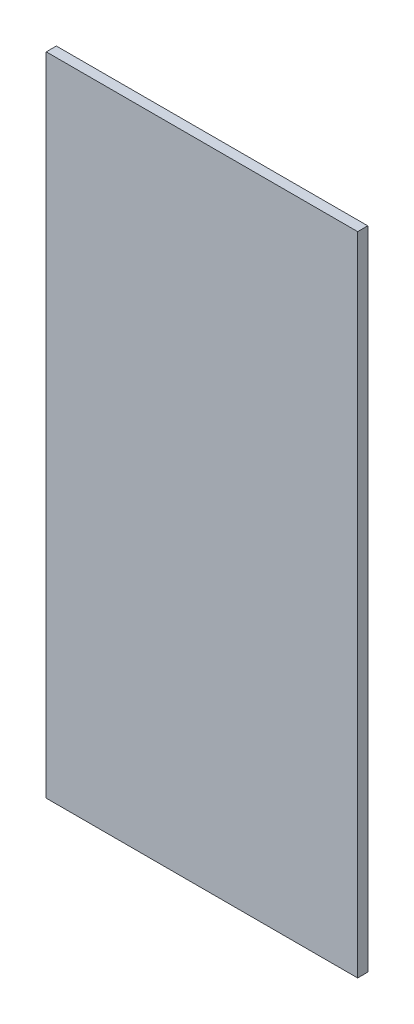
ISO-10303-21;
HEADER;
FILE_DESCRIPTION(('STEP AP214'),'2;1');
FILE_NAME('part.step','',(''),(''),'','','');
FILE_SCHEMA(('AUTOMOTIVE_DESIGN { 1 0 10303 214 1 1 1 1 }'));
ENDSEC;
DATA;
#1=APPLICATION_CONTEXT('core data for automotive mechanical design processes');
#2=APPLICATION_PROTOCOL_DEFINITION('international standard','automotive_design',2000,#1);
#3=PRODUCT_CONTEXT('',#1,'mechanical');
#4=PRODUCT('Part','Part','',(#3));
#5=PRODUCT_RELATED_PRODUCT_CATEGORY('part','',(#4));
#6=PRODUCT_DEFINITION_FORMATION('','',#4);
#7=PRODUCT_DEFINITION_CONTEXT('part definition',#1,'design');
#8=PRODUCT_DEFINITION('design','',#6,#7);
#9=PRODUCT_DEFINITION_SHAPE('','',#8);
#10=(LENGTH_UNIT() NAMED_UNIT(*) SI_UNIT(.MILLI.,.METRE.));
#11=(NAMED_UNIT(*) PLANE_ANGLE_UNIT() SI_UNIT($,.RADIAN.));
#12=(NAMED_UNIT(*) SI_UNIT($,.STERADIAN.) SOLID_ANGLE_UNIT());
#13=UNCERTAINTY_MEASURE_WITH_UNIT(LENGTH_MEASURE(1.E-05),#10,'distance_accuracy_value','');
#14=(GEOMETRIC_REPRESENTATION_CONTEXT(3) GLOBAL_UNCERTAINTY_ASSIGNED_CONTEXT((#13)) GLOBAL_UNIT_ASSIGNED_CONTEXT((#10,
#11,#12)) REPRESENTATION_CONTEXT('',''));
#15=CARTESIAN_POINT('',(0.,0.,0.));
#16=DIRECTION('',(0.,0.,1.));
#17=DIRECTION('',(1.,0.,0.));
#18=AXIS2_PLACEMENT_3D('',#15,#16,#17);
#19=CARTESIAN_POINT('',(-92.5,-192.,6.));
#20=DIRECTION('',(1.,0.,0.));
#21=DIRECTION('',(0.,0.,-1.));
#22=AXIS2_PLACEMENT_3D('',#19,#20,#21);
#23=PLANE('',#22);
#24=DIRECTION('',(0.,-1.,0.));
#25=VECTOR('',#24,1.);
#26=CARTESIAN_POINT('',(-92.5,-192.,0.));
#27=LINE('',#26,#25);
#28=CARTESIAN_POINT('',(-92.5,192.,0.));
#29=VERTEX_POINT('',#28);
#30=CARTESIAN_POINT('',(-92.5,-192.,0.));
#31=VERTEX_POINT('',#30);
#32=EDGE_CURVE('E96',#29,#31,#27,.T.);
#33=ORIENTED_EDGE('',*,*,#32,.T.);
#34=DIRECTION('',(0.,0.,-1.));
#35=VECTOR('',#34,1.);
#36=CARTESIAN_POINT('',(-92.5,-192.,6.));
#37=LINE('',#36,#35);
#38=CARTESIAN_POINT('',(-92.5,-192.,6.));
#39=VERTEX_POINT('',#38);
#40=EDGE_CURVE('E11',#39,#31,#37,.T.);
#41=ORIENTED_EDGE('',*,*,#40,.F.);
#42=DIRECTION('',(0.,-1.,0.));
#43=VECTOR('',#42,1.);
#44=CARTESIAN_POINT('',(-92.5,-192.,6.));
#45=LINE('',#44,#43);
#46=CARTESIAN_POINT('',(-92.5,192.,6.));
#47=VERTEX_POINT('',#46);
#48=EDGE_CURVE('E84',#47,#39,#45,.T.);
#49=ORIENTED_EDGE('',*,*,#48,.F.);
#50=DIRECTION('',(0.,0.,-1.));
#51=VECTOR('',#50,1.);
#52=CARTESIAN_POINT('',(-92.5,192.,6.));
#53=LINE('',#52,#51);
#54=EDGE_CURVE('E92',#47,#29,#53,.T.);
#55=ORIENTED_EDGE('',*,*,#54,.T.);
#56=EDGE_LOOP('',(#33,#41,#49,#55));
#57=FACE_BOUND('',#56,.T.);
#58=ADVANCED_FACE('F33',(#57),#23,.F.);
#59=CARTESIAN_POINT('',(92.5,-192.,6.));
#60=DIRECTION('',(0.,1.,0.));
#61=DIRECTION('',(0.,0.,1.));
#62=AXIS2_PLACEMENT_3D('',#59,#60,#61);
#63=PLANE('',#62);
#64=DIRECTION('',(1.,0.,0.));
#65=VECTOR('',#64,1.);
#66=CARTESIAN_POINT('',(92.5,-192.,0.));
#67=LINE('',#66,#65);
#68=CARTESIAN_POINT('',(92.5,-192.,0.));
#69=VERTEX_POINT('',#68);
#70=EDGE_CURVE('E88',#31,#69,#67,.T.);
#71=ORIENTED_EDGE('',*,*,#70,.T.);
#72=DIRECTION('',(0.,0.,-1.));
#73=VECTOR('',#72,1.);
#74=CARTESIAN_POINT('',(92.5,-192.,6.));
#75=LINE('',#74,#73);
#76=CARTESIAN_POINT('',(92.5,-192.,6.));
#77=VERTEX_POINT('',#76);
#78=EDGE_CURVE('E41',#77,#69,#75,.T.);
#79=ORIENTED_EDGE('',*,*,#78,.F.);
#80=DIRECTION('',(1.,0.,0.));
#81=VECTOR('',#80,1.);
#82=CARTESIAN_POINT('',(92.5,-192.,6.));
#83=LINE('',#82,#81);
#84=EDGE_CURVE('E79',#39,#77,#83,.T.);
#85=ORIENTED_EDGE('',*,*,#84,.F.);
#86=ORIENTED_EDGE('',*,*,#40,.T.);
#87=EDGE_LOOP('',(#71,#79,#85,#86));
#88=FACE_BOUND('',#87,.T.);
#89=ADVANCED_FACE('F87',(#88),#63,.F.);
#90=CARTESIAN_POINT('',(92.5,-192.,6.));
#91=DIRECTION('',(-1.,0.,0.));
#92=DIRECTION('',(0.,0.,1.));
#93=AXIS2_PLACEMENT_3D('',#90,#91,#92);
#94=PLANE('',#93);
#95=DIRECTION('',(0.,1.,0.));
#96=VECTOR('',#95,1.);
#97=CARTESIAN_POINT('',(92.5,-192.,0.));
#98=LINE('',#97,#96);
#99=CARTESIAN_POINT('',(92.5,192.,0.));
#100=VERTEX_POINT('',#99);
#101=EDGE_CURVE('E66',#69,#100,#98,.T.);
#102=ORIENTED_EDGE('',*,*,#101,.T.);
#103=DIRECTION('',(0.,0.,-1.));
#104=VECTOR('',#103,1.);
#105=CARTESIAN_POINT('',(92.5,192.,6.));
#106=LINE('',#105,#104);
#107=CARTESIAN_POINT('',(92.5,192.,6.));
#108=VERTEX_POINT('',#107);
#109=EDGE_CURVE('E89',#108,#100,#106,.T.);
#110=ORIENTED_EDGE('',*,*,#109,.F.);
#111=DIRECTION('',(0.,1.,0.));
#112=VECTOR('',#111,1.);
#113=CARTESIAN_POINT('',(92.5,-192.,6.));
#114=LINE('',#113,#112);
#115=EDGE_CURVE('E82',#77,#108,#114,.T.);
#116=ORIENTED_EDGE('',*,*,#115,.F.);
#117=ORIENTED_EDGE('',*,*,#78,.T.);
#118=EDGE_LOOP('',(#102,#110,#116,#117));
#119=FACE_BOUND('',#118,.T.);
#120=ADVANCED_FACE('F90',(#119),#94,.F.);
#121=CARTESIAN_POINT('',(92.5,192.,6.));
#122=DIRECTION('',(0.,-1.,0.));
#123=DIRECTION('',(0.,0.,-1.));
#124=AXIS2_PLACEMENT_3D('',#121,#122,#123);
#125=PLANE('',#124);
#126=DIRECTION('',(-1.,0.,0.));
#127=VECTOR('',#126,1.);
#128=CARTESIAN_POINT('',(92.5,192.,0.));
#129=LINE('',#128,#127);
#130=EDGE_CURVE('E72',#100,#29,#129,.T.);
#131=ORIENTED_EDGE('',*,*,#130,.T.);
#132=ORIENTED_EDGE('',*,*,#54,.F.);
#133=DIRECTION('',(-1.,0.,0.));
#134=VECTOR('',#133,1.);
#135=CARTESIAN_POINT('',(92.5,192.,6.));
#136=LINE('',#135,#134);
#137=EDGE_CURVE('E49',#108,#47,#136,.T.);
#138=ORIENTED_EDGE('',*,*,#137,.F.);
#139=ORIENTED_EDGE('',*,*,#109,.T.);
#140=EDGE_LOOP('',(#131,#132,#138,#139));
#141=FACE_BOUND('',#140,.T.);
#142=ADVANCED_FACE('F103',(#141),#125,.F.);
#143=CARTESIAN_POINT('',(0.,0.,6.));
#144=DIRECTION('',(0.,0.,1.));
#145=DIRECTION('',(1.,0.,0.));
#146=AXIS2_PLACEMENT_3D('',#143,#144,#145);
#147=PLANE('',#146);
#148=ORIENTED_EDGE('',*,*,#48,.T.);
#149=ORIENTED_EDGE('',*,*,#84,.T.);
#150=ORIENTED_EDGE('',*,*,#115,.T.);
#151=ORIENTED_EDGE('',*,*,#137,.T.);
#152=EDGE_LOOP('',(#148,#149,#150,#151));
#153=FACE_BOUND('',#152,.T.);
#154=ADVANCED_FACE('F80',(#153),#147,.T.);
#155=CARTESIAN_POINT('',(0.,0.,0.));
#156=DIRECTION('',(0.,0.,1.));
#157=DIRECTION('',(1.,0.,0.));
#158=AXIS2_PLACEMENT_3D('',#155,#156,#157);
#159=PLANE('',#158);
#160=ORIENTED_EDGE('',*,*,#32,.F.);
#161=ORIENTED_EDGE('',*,*,#130,.F.);
#162=ORIENTED_EDGE('',*,*,#101,.F.);
#163=ORIENTED_EDGE('',*,*,#70,.F.);
#164=EDGE_LOOP('',(#160,#161,#162,#163));
#165=FACE_BOUND('',#164,.T.);
#166=ADVANCED_FACE('F106',(#165),#159,.F.);
#167=CLOSED_SHELL('',(#58,#89,#120,#142,#154,#166));
#168=MANIFOLD_SOLID_BREP('B2',#167);
#169=ADVANCED_BREP_SHAPE_REPRESENTATION('',(#18,#168),#14);
#170=SHAPE_DEFINITION_REPRESENTATION(#9,#169);
ENDSEC;
END-ISO-10303-21;
